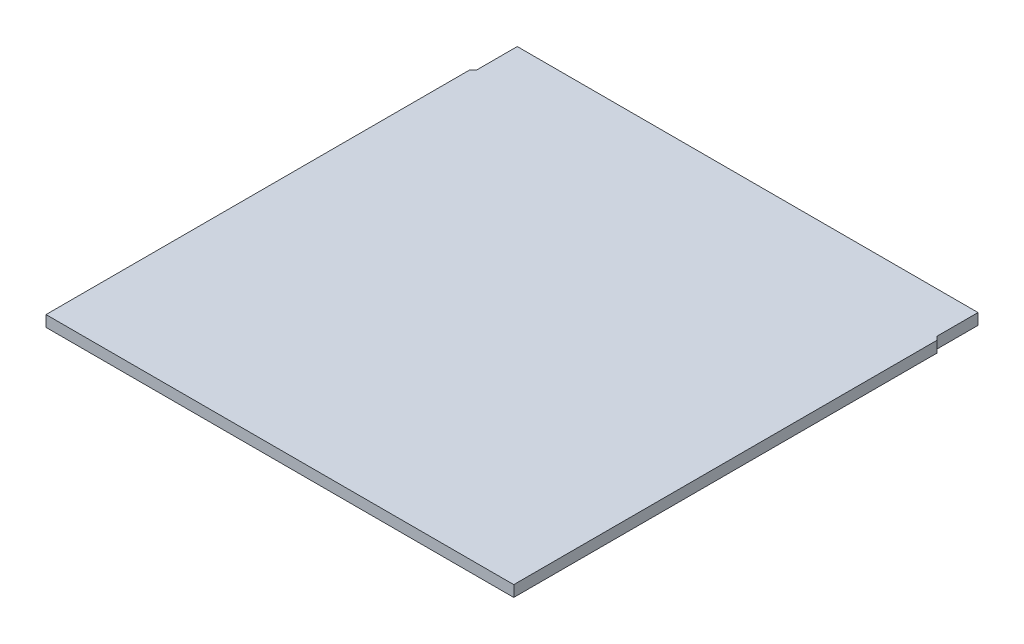
ISO-10303-21;
HEADER;
FILE_DESCRIPTION(('STEP AP214'),'2;1');
FILE_NAME('part.step','',(''),(''),'','','');
FILE_SCHEMA(('AUTOMOTIVE_DESIGN { 1 0 10303 214 1 1 1 1 }'));
ENDSEC;
DATA;
#1=APPLICATION_CONTEXT('core data for automotive mechanical design processes');
#2=APPLICATION_PROTOCOL_DEFINITION('international standard','automotive_design',2000,#1);
#3=PRODUCT_CONTEXT('',#1,'mechanical');
#4=PRODUCT('Part','Part','',(#3));
#5=PRODUCT_RELATED_PRODUCT_CATEGORY('part','',(#4));
#6=PRODUCT_DEFINITION_FORMATION('','',#4);
#7=PRODUCT_DEFINITION_CONTEXT('part definition',#1,'design');
#8=PRODUCT_DEFINITION('design','',#6,#7);
#9=PRODUCT_DEFINITION_SHAPE('','',#8);
#10=(LENGTH_UNIT() NAMED_UNIT(*) SI_UNIT(.MILLI.,.METRE.));
#11=(NAMED_UNIT(*) PLANE_ANGLE_UNIT() SI_UNIT($,.RADIAN.));
#12=(NAMED_UNIT(*) SI_UNIT($,.STERADIAN.) SOLID_ANGLE_UNIT());
#13=UNCERTAINTY_MEASURE_WITH_UNIT(LENGTH_MEASURE(1.E-05),#10,'distance_accuracy_value','');
#14=(GEOMETRIC_REPRESENTATION_CONTEXT(3) GLOBAL_UNCERTAINTY_ASSIGNED_CONTEXT((#13)) GLOBAL_UNIT_ASSIGNED_CONTEXT((#10,
#11,#12)) REPRESENTATION_CONTEXT('',''));
#15=CARTESIAN_POINT('',(0.,0.,0.));
#16=DIRECTION('',(0.,0.,1.));
#17=DIRECTION('',(1.,0.,0.));
#18=AXIS2_PLACEMENT_3D('',#15,#16,#17);
#19=CARTESIAN_POINT('',(-200.,9.525,-200.));
#20=DIRECTION('',(1.,0.,0.));
#21=DIRECTION('',(0.,0.,-1.));
#22=AXIS2_PLACEMENT_3D('',#19,#20,#21);
#23=PLANE('',#22);
#24=DIRECTION('',(0.,1.,0.));
#25=VECTOR('',#24,1.);
#26=CARTESIAN_POINT('',(-200.,0.,-162.));
#27=LINE('',#26,#25);
#28=CARTESIAN_POINT('',(-200.,0.,-162.));
#29=VERTEX_POINT('',#28);
#30=CARTESIAN_POINT('',(-200.,9.525,-162.));
#31=VERTEX_POINT('',#30);
#32=EDGE_CURVE('E98',#29,#31,#27,.T.);
#33=ORIENTED_EDGE('',*,*,#32,.F.);
#34=DIRECTION('',(0.,0.,1.));
#35=VECTOR('',#34,1.);
#36=CARTESIAN_POINT('',(-200.,0.,-200.));
#37=LINE('',#36,#35);
#38=CARTESIAN_POINT('',(-200.,0.,200.));
#39=VERTEX_POINT('',#38);
#40=EDGE_CURVE('E109',#29,#39,#37,.T.);
#41=ORIENTED_EDGE('',*,*,#40,.T.);
#42=DIRECTION('',(0.,-1.,0.));
#43=VECTOR('',#42,1.);
#44=CARTESIAN_POINT('',(-200.,9.525,200.));
#45=LINE('',#44,#43);
#46=CARTESIAN_POINT('',(-200.,9.525,200.));
#47=VERTEX_POINT('',#46);
#48=EDGE_CURVE('E11',#47,#39,#45,.T.);
#49=ORIENTED_EDGE('',*,*,#48,.F.);
#50=DIRECTION('',(0.,0.,1.));
#51=VECTOR('',#50,1.);
#52=CARTESIAN_POINT('',(-200.,9.525,-200.));
#53=LINE('',#52,#51);
#54=EDGE_CURVE('E111',#31,#47,#53,.T.);
#55=ORIENTED_EDGE('',*,*,#54,.F.);
#56=EDGE_LOOP('',(#33,#41,#49,#55));
#57=FACE_BOUND('',#56,.T.);
#58=ADVANCED_FACE('F33',(#57),#23,.F.);
#59=CARTESIAN_POINT('',(200.,9.525,-200.));
#60=DIRECTION('',(0.,0.,1.));
#61=DIRECTION('',(1.,0.,0.));
#62=AXIS2_PLACEMENT_3D('',#59,#60,#61);
#63=PLANE('',#62);
#64=DIRECTION('',(0.,1.,0.));
#65=VECTOR('',#64,1.);
#66=CARTESIAN_POINT('',(-197.,0.,-200.));
#67=LINE('',#66,#65);
#68=CARTESIAN_POINT('',(-197.,0.,-200.));
#69=VERTEX_POINT('',#68);
#70=CARTESIAN_POINT('',(-197.,9.525,-200.));
#71=VERTEX_POINT('',#70);
#72=EDGE_CURVE('E156',#69,#71,#67,.T.);
#73=ORIENTED_EDGE('',*,*,#72,.T.);
#74=DIRECTION('',(-1.,0.,0.));
#75=VECTOR('',#74,1.);
#76=CARTESIAN_POINT('',(200.,9.525,-200.));
#77=LINE('',#76,#75);
#78=CARTESIAN_POINT('',(197.,9.525,-200.));
#79=VERTEX_POINT('',#78);
#80=EDGE_CURVE('E124',#79,#71,#77,.T.);
#81=ORIENTED_EDGE('',*,*,#80,.F.);
#82=DIRECTION('',(0.,1.,0.));
#83=VECTOR('',#82,1.);
#84=CARTESIAN_POINT('',(197.,0.,-200.));
#85=LINE('',#84,#83);
#86=CARTESIAN_POINT('',(197.,0.,-200.));
#87=VERTEX_POINT('',#86);
#88=EDGE_CURVE('E147',#87,#79,#85,.T.);
#89=ORIENTED_EDGE('',*,*,#88,.F.);
#90=DIRECTION('',(-1.,0.,0.));
#91=VECTOR('',#90,1.);
#92=CARTESIAN_POINT('',(200.,0.,-200.));
#93=LINE('',#92,#91);
#94=EDGE_CURVE('E129',#87,#69,#93,.T.);
#95=ORIENTED_EDGE('',*,*,#94,.T.);
#96=EDGE_LOOP('',(#73,#81,#89,#95));
#97=FACE_BOUND('',#96,.T.);
#98=ADVANCED_FACE('F171',(#97),#63,.F.);
#99=CARTESIAN_POINT('',(0.,9.525,0.));
#100=DIRECTION('',(0.,-1.,0.));
#101=DIRECTION('',(0.,0.,-1.));
#102=AXIS2_PLACEMENT_3D('',#99,#100,#101);
#103=PLANE('',#102);
#104=DIRECTION('',(0.,0.,1.));
#105=VECTOR('',#104,1.);
#106=CARTESIAN_POINT('',(-197.,9.525,-200.));
#107=LINE('',#106,#105);
#108=CARTESIAN_POINT('',(-197.,9.525,-165.));
#109=VERTEX_POINT('',#108);
#110=EDGE_CURVE('E104',#71,#109,#107,.T.);
#111=ORIENTED_EDGE('',*,*,#110,.T.);
#112=DIRECTION('',(-0.707106781186531,0.,0.707106781186564));
#113=VECTOR('',#112,1.);
#114=CARTESIAN_POINT('',(-197.,9.525,-165.));
#115=LINE('',#114,#113);
#116=EDGE_CURVE('E164',#109,#31,#115,.T.);
#117=ORIENTED_EDGE('',*,*,#116,.T.);
#118=ORIENTED_EDGE('',*,*,#54,.T.);
#119=DIRECTION('',(1.,0.,0.));
#120=VECTOR('',#119,1.);
#121=CARTESIAN_POINT('',(200.,9.525,200.));
#122=LINE('',#121,#120);
#123=CARTESIAN_POINT('',(200.,9.525,200.));
#124=VERTEX_POINT('',#123);
#125=EDGE_CURVE('E142',#47,#124,#122,.T.);
#126=ORIENTED_EDGE('',*,*,#125,.T.);
#127=DIRECTION('',(0.,0.,-1.));
#128=VECTOR('',#127,1.);
#129=CARTESIAN_POINT('',(200.,9.525,-200.));
#130=LINE('',#129,#128);
#131=CARTESIAN_POINT('',(200.,9.525,-162.));
#132=VERTEX_POINT('',#131);
#133=EDGE_CURVE('E136',#124,#132,#130,.T.);
#134=ORIENTED_EDGE('',*,*,#133,.T.);
#135=DIRECTION('',(0.707106781186531,0.,0.707106781186564));
#136=VECTOR('',#135,1.);
#137=CARTESIAN_POINT('',(197.,9.525,-165.));
#138=LINE('',#137,#136);
#139=CARTESIAN_POINT('',(197.,9.525,-165.));
#140=VERTEX_POINT('',#139);
#141=EDGE_CURVE('E150',#140,#132,#138,.T.);
#142=ORIENTED_EDGE('',*,*,#141,.F.);
#143=DIRECTION('',(0.,0.,1.));
#144=VECTOR('',#143,1.);
#145=CARTESIAN_POINT('',(197.,9.525,-200.));
#146=LINE('',#145,#144);
#147=EDGE_CURVE('E153',#79,#140,#146,.T.);
#148=ORIENTED_EDGE('',*,*,#147,.F.);
#149=ORIENTED_EDGE('',*,*,#80,.T.);
#150=EDGE_LOOP('',(#111,#117,#118,#126,#134,#142,#148,#149));
#151=FACE_BOUND('',#150,.T.);
#152=ADVANCED_FACE('F174',(#151),#103,.F.);
#153=CARTESIAN_POINT('',(0.,0.,0.));
#154=DIRECTION('',(0.,-1.,0.));
#155=DIRECTION('',(0.,0.,-1.));
#156=AXIS2_PLACEMENT_3D('',#153,#154,#155);
#157=PLANE('',#156);
#158=DIRECTION('',(-0.707106781186531,0.,0.707106781186564));
#159=VECTOR('',#158,1.);
#160=CARTESIAN_POINT('',(-197.,0.,-165.));
#161=LINE('',#160,#159);
#162=CARTESIAN_POINT('',(-197.,0.,-165.));
#163=VERTEX_POINT('',#162);
#164=EDGE_CURVE('E95',#163,#29,#161,.T.);
#165=ORIENTED_EDGE('',*,*,#164,.F.);
#166=DIRECTION('',(0.,0.,1.));
#167=VECTOR('',#166,1.);
#168=CARTESIAN_POINT('',(-197.,0.,-200.));
#169=LINE('',#168,#167);
#170=EDGE_CURVE('E103',#69,#163,#169,.T.);
#171=ORIENTED_EDGE('',*,*,#170,.F.);
#172=ORIENTED_EDGE('',*,*,#94,.F.);
#173=DIRECTION('',(0.,0.,1.));
#174=VECTOR('',#173,1.);
#175=CARTESIAN_POINT('',(197.,0.,-200.));
#176=LINE('',#175,#174);
#177=CARTESIAN_POINT('',(197.,0.,-165.));
#178=VERTEX_POINT('',#177);
#179=EDGE_CURVE('E152',#87,#178,#176,.T.);
#180=ORIENTED_EDGE('',*,*,#179,.T.);
#181=DIRECTION('',(0.707106781186531,0.,0.707106781186564));
#182=VECTOR('',#181,1.);
#183=CARTESIAN_POINT('',(197.,0.,-165.));
#184=LINE('',#183,#182);
#185=CARTESIAN_POINT('',(200.,0.,-162.));
#186=VERTEX_POINT('',#185);
#187=EDGE_CURVE('E55',#178,#186,#184,.T.);
#188=ORIENTED_EDGE('',*,*,#187,.T.);
#189=DIRECTION('',(0.,0.,-1.));
#190=VECTOR('',#189,1.);
#191=CARTESIAN_POINT('',(200.,0.,-200.));
#192=LINE('',#191,#190);
#193=CARTESIAN_POINT('',(200.,0.,200.));
#194=VERTEX_POINT('',#193);
#195=EDGE_CURVE('E118',#194,#186,#192,.T.);
#196=ORIENTED_EDGE('',*,*,#195,.F.);
#197=DIRECTION('',(1.,0.,0.));
#198=VECTOR('',#197,1.);
#199=CARTESIAN_POINT('',(200.,0.,200.));
#200=LINE('',#199,#198);
#201=EDGE_CURVE('E115',#39,#194,#200,.T.);
#202=ORIENTED_EDGE('',*,*,#201,.F.);
#203=ORIENTED_EDGE('',*,*,#40,.F.);
#204=EDGE_LOOP('',(#165,#171,#172,#180,#188,#196,#202,#203));
#205=FACE_BOUND('',#204,.T.);
#206=ADVANCED_FACE('F113',(#205),#157,.T.);
#207=CARTESIAN_POINT('',(200.,9.525,200.));
#208=DIRECTION('',(0.,0.,-1.));
#209=DIRECTION('',(-1.,0.,0.));
#210=AXIS2_PLACEMENT_3D('',#207,#208,#209);
#211=PLANE('',#210);
#212=ORIENTED_EDGE('',*,*,#201,.T.);
#213=DIRECTION('',(0.,-1.,0.));
#214=VECTOR('',#213,1.);
#215=CARTESIAN_POINT('',(200.,9.525,200.));
#216=LINE('',#215,#214);
#217=EDGE_CURVE('E40',#124,#194,#216,.T.);
#218=ORIENTED_EDGE('',*,*,#217,.F.);
#219=ORIENTED_EDGE('',*,*,#125,.F.);
#220=ORIENTED_EDGE('',*,*,#48,.T.);
#221=EDGE_LOOP('',(#212,#218,#219,#220));
#222=FACE_BOUND('',#221,.T.);
#223=ADVANCED_FACE('F178',(#222),#211,.F.);
#224=CARTESIAN_POINT('',(200.,9.525,-200.));
#225=DIRECTION('',(-1.,0.,0.));
#226=DIRECTION('',(0.,0.,1.));
#227=AXIS2_PLACEMENT_3D('',#224,#225,#226);
#228=PLANE('',#227);
#229=ORIENTED_EDGE('',*,*,#195,.T.);
#230=DIRECTION('',(0.,1.,0.));
#231=VECTOR('',#230,1.);
#232=CARTESIAN_POINT('',(200.,0.,-162.));
#233=LINE('',#232,#231);
#234=EDGE_CURVE('E116',#186,#132,#233,.T.);
#235=ORIENTED_EDGE('',*,*,#234,.T.);
#236=ORIENTED_EDGE('',*,*,#133,.F.);
#237=ORIENTED_EDGE('',*,*,#217,.T.);
#238=EDGE_LOOP('',(#229,#235,#236,#237));
#239=FACE_BOUND('',#238,.T.);
#240=ADVANCED_FACE('F176',(#239),#228,.F.);
#241=CARTESIAN_POINT('',(197.,0.,-165.));
#242=DIRECTION('',(-0.707106781186564,0.,0.707106781186531));
#243=DIRECTION('',(0.707106781186531,0.,0.707106781186564));
#244=AXIS2_PLACEMENT_3D('',#241,#242,#243);
#245=PLANE('',#244);
#246=ORIENTED_EDGE('',*,*,#141,.T.);
#247=ORIENTED_EDGE('',*,*,#234,.F.);
#248=ORIENTED_EDGE('',*,*,#187,.F.);
#249=DIRECTION('',(0.,1.,0.));
#250=VECTOR('',#249,1.);
#251=CARTESIAN_POINT('',(197.,0.,-165.));
#252=LINE('',#251,#250);
#253=EDGE_CURVE('E121',#178,#140,#252,.T.);
#254=ORIENTED_EDGE('',*,*,#253,.T.);
#255=EDGE_LOOP('',(#246,#247,#248,#254));
#256=FACE_BOUND('',#255,.T.);
#257=ADVANCED_FACE('F175',(#256),#245,.F.);
#258=CARTESIAN_POINT('',(197.,0.,-200.));
#259=DIRECTION('',(-1.,0.,0.));
#260=DIRECTION('',(0.,0.,1.));
#261=AXIS2_PLACEMENT_3D('',#258,#259,#260);
#262=PLANE('',#261);
#263=ORIENTED_EDGE('',*,*,#147,.T.);
#264=ORIENTED_EDGE('',*,*,#253,.F.);
#265=ORIENTED_EDGE('',*,*,#179,.F.);
#266=ORIENTED_EDGE('',*,*,#88,.T.);
#267=EDGE_LOOP('',(#263,#264,#265,#266));
#268=FACE_BOUND('',#267,.T.);
#269=ADVANCED_FACE('F173',(#268),#262,.F.);
#270=CARTESIAN_POINT('',(-197.,0.,-200.));
#271=DIRECTION('',(-1.,0.,0.));
#272=DIRECTION('',(0.,0.,1.));
#273=AXIS2_PLACEMENT_3D('',#270,#271,#272);
#274=PLANE('',#273);
#275=ORIENTED_EDGE('',*,*,#110,.F.);
#276=ORIENTED_EDGE('',*,*,#72,.F.);
#277=ORIENTED_EDGE('',*,*,#170,.T.);
#278=DIRECTION('',(0.,1.,0.));
#279=VECTOR('',#278,1.);
#280=CARTESIAN_POINT('',(-197.,0.,-165.));
#281=LINE('',#280,#279);
#282=EDGE_CURVE('E47',#163,#109,#281,.T.);
#283=ORIENTED_EDGE('',*,*,#282,.T.);
#284=EDGE_LOOP('',(#275,#276,#277,#283));
#285=FACE_BOUND('',#284,.T.);
#286=ADVANCED_FACE('F167',(#285),#274,.T.);
#287=CARTESIAN_POINT('',(-197.,0.,-165.));
#288=DIRECTION('',(-0.707106781186564,0.,-0.707106781186531));
#289=DIRECTION('',(-0.707106781186531,0.,0.707106781186564));
#290=AXIS2_PLACEMENT_3D('',#287,#288,#289);
#291=PLANE('',#290);
#292=ORIENTED_EDGE('',*,*,#116,.F.);
#293=ORIENTED_EDGE('',*,*,#282,.F.);
#294=ORIENTED_EDGE('',*,*,#164,.T.);
#295=ORIENTED_EDGE('',*,*,#32,.T.);
#296=EDGE_LOOP('',(#292,#293,#294,#295));
#297=FACE_BOUND('',#296,.T.);
#298=ADVANCED_FACE('F97',(#297),#291,.T.);
#299=CLOSED_SHELL('',(#58,#98,#152,#206,#223,#240,#257,#269,#286,#298));
#300=MANIFOLD_SOLID_BREP('B2',#299);
#301=ADVANCED_BREP_SHAPE_REPRESENTATION('',(#18,#300),#14);
#302=SHAPE_DEFINITION_REPRESENTATION(#9,#301);
ENDSEC;
END-ISO-10303-21;
